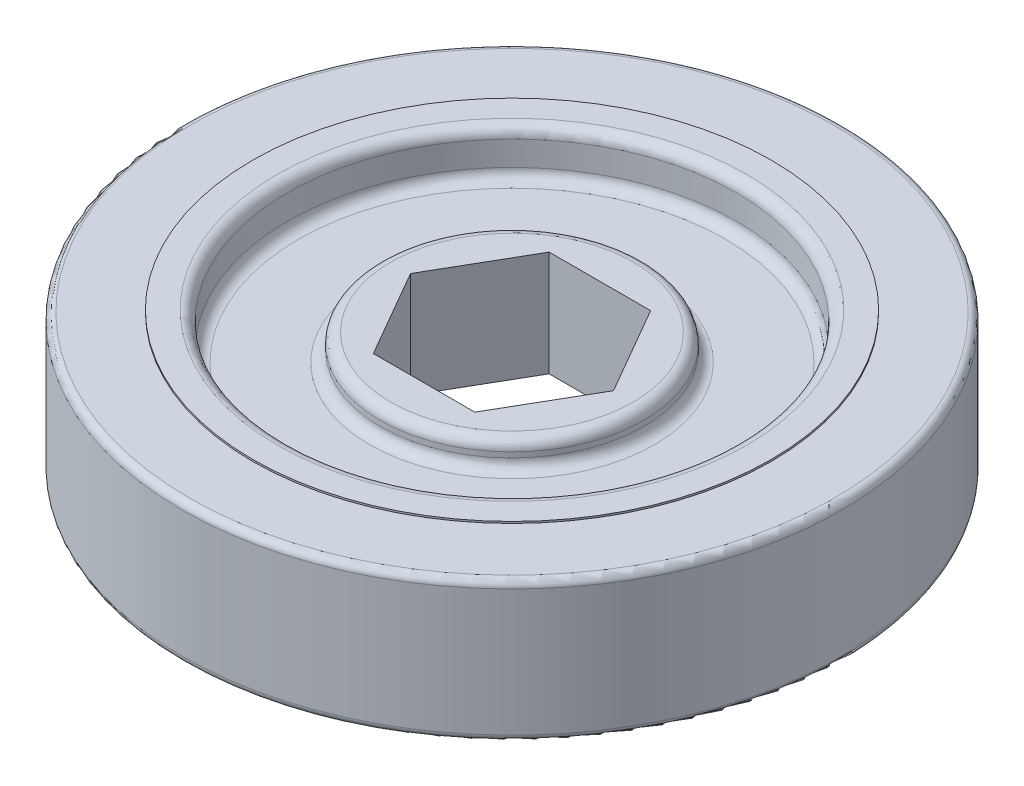
ISO-10303-21;
HEADER;
FILE_DESCRIPTION(('STEP AP214'),'2;1');
FILE_NAME('part.step','',(''),(''),'','','');
FILE_SCHEMA(('AUTOMOTIVE_DESIGN { 1 0 10303 214 1 1 1 1 }'));
ENDSEC;
DATA;
#1=APPLICATION_CONTEXT('core data for automotive mechanical design processes');
#2=APPLICATION_PROTOCOL_DEFINITION('international standard','automotive_design',2000,#1);
#3=PRODUCT_CONTEXT('',#1,'mechanical');
#4=PRODUCT('Part','Part','',(#3));
#5=PRODUCT_RELATED_PRODUCT_CATEGORY('part','',(#4));
#6=PRODUCT_DEFINITION_FORMATION('','',#4);
#7=PRODUCT_DEFINITION_CONTEXT('part definition',#1,'design');
#8=PRODUCT_DEFINITION('design','',#6,#7);
#9=PRODUCT_DEFINITION_SHAPE('','',#8);
#10=(LENGTH_UNIT() NAMED_UNIT(*) SI_UNIT(.MILLI.,.METRE.));
#11=(NAMED_UNIT(*) PLANE_ANGLE_UNIT() SI_UNIT($,.RADIAN.));
#12=(NAMED_UNIT(*) SI_UNIT($,.STERADIAN.) SOLID_ANGLE_UNIT());
#13=UNCERTAINTY_MEASURE_WITH_UNIT(LENGTH_MEASURE(1.E-05),#10,'distance_accuracy_value','');
#14=(GEOMETRIC_REPRESENTATION_CONTEXT(3) GLOBAL_UNCERTAINTY_ASSIGNED_CONTEXT((#13)) GLOBAL_UNIT_ASSIGNED_CONTEXT((#10,
#11,#12)) REPRESENTATION_CONTEXT('',''));
#15=CARTESIAN_POINT('',(0.,0.,0.));
#16=DIRECTION('',(0.,0.,1.));
#17=DIRECTION('',(1.,0.,0.));
#18=AXIS2_PLACEMENT_3D('',#15,#16,#17);
#19=CARTESIAN_POINT('',(0.,5.207,0.));
#20=DIRECTION('',(0.,-1.,0.));
#21=DIRECTION('',(0.,0.,-1.));
#22=AXIS2_PLACEMENT_3D('',#19,#20,#21);
#23=CYLINDRICAL_SURFACE('',#22,16.1925);
#24=CARTESIAN_POINT('',(0.,-2.667,0.));
#25=DIRECTION('',(0.,1.,0.));
#26=DIRECTION('',(0.,0.,1.));
#27=AXIS2_PLACEMENT_3D('',#24,#25,#26);
#28=CIRCLE('',#27,16.1925);
#29=CARTESIAN_POINT('',(0.,-2.667,16.1925));
#30=VERTEX_POINT('',#29);
#31=EDGE_CURVE('E184',#30,#30,#28,.T.);
#32=ORIENTED_EDGE('',*,*,#31,.T.);
#33=EDGE_LOOP('',(#32));
#34=FACE_BOUND('',#33,.T.);
#35=CARTESIAN_POINT('',(0.,-4.445,0.));
#36=DIRECTION('',(0.,1.,0.));
#37=DIRECTION('',(0.,0.,1.));
#38=AXIS2_PLACEMENT_3D('',#35,#36,#37);
#39=CIRCLE('',#38,16.1925);
#40=CARTESIAN_POINT('',(0.,-4.445,16.1925));
#41=VERTEX_POINT('',#40);
#42=EDGE_CURVE('E180',#41,#41,#39,.F.);
#43=ORIENTED_EDGE('',*,*,#42,.T.);
#44=EDGE_LOOP('',(#43));
#45=FACE_BOUND('',#44,.T.);
#46=ADVANCED_FACE('F43',(#34,#45),#23,.F.);
#47=CARTESIAN_POINT('',(0.,5.08,0.));
#48=DIRECTION('',(0.,-1.,0.));
#49=DIRECTION('',(0.,0.,-1.));
#50=AXIS2_PLACEMENT_3D('',#47,#48,#49);
#51=CYLINDRICAL_SURFACE('',#50,23.8125);
#52=CARTESIAN_POINT('',(0.,-4.572,0.));
#53=DIRECTION('',(0.,1.,0.));
#54=DIRECTION('',(0.,0.,1.));
#55=AXIS2_PLACEMENT_3D('',#52,#53,#54);
#56=CIRCLE('',#55,23.8125);
#57=CARTESIAN_POINT('',(0.,-4.572,23.8125));
#58=VERTEX_POINT('',#57);
#59=EDGE_CURVE('E248',#58,#58,#56,.T.);
#60=ORIENTED_EDGE('',*,*,#59,.T.);
#61=EDGE_LOOP('',(#60));
#62=FACE_BOUND('',#61,.T.);
#63=CARTESIAN_POINT('',(0.,4.572,0.));
#64=DIRECTION('',(0.,1.,0.));
#65=DIRECTION('',(0.,0.,1.));
#66=AXIS2_PLACEMENT_3D('',#63,#64,#65);
#67=CIRCLE('',#66,23.8125);
#68=CARTESIAN_POINT('',(0.,4.572,23.8125));
#69=VERTEX_POINT('',#68);
#70=EDGE_CURVE('E244',#69,#69,#67,.F.);
#71=ORIENTED_EDGE('',*,*,#70,.T.);
#72=EDGE_LOOP('',(#71));
#73=FACE_BOUND('',#72,.T.);
#74=ADVANCED_FACE('F264',(#62,#73),#51,.T.);
#75=CARTESIAN_POINT('',(0.,5.08,0.));
#76=DIRECTION('',(0.,1.,0.));
#77=DIRECTION('',(0.,0.,1.));
#78=AXIS2_PLACEMENT_3D('',#75,#76,#77);
#79=PLANE('',#78);
#80=CARTESIAN_POINT('',(0.,5.08,0.));
#81=DIRECTION('',(0.,1.,0.));
#82=DIRECTION('',(0.,0.,1.));
#83=AXIS2_PLACEMENT_3D('',#80,#81,#82);
#84=CIRCLE('',#83,23.3045);
#85=CARTESIAN_POINT('',(0.,5.08,23.3045));
#86=VERTEX_POINT('',#85);
#87=EDGE_CURVE('E11',#86,#86,#84,.T.);
#88=ORIENTED_EDGE('',*,*,#87,.T.);
#89=EDGE_LOOP('',(#88));
#90=FACE_BOUND('',#89,.T.);
#91=CARTESIAN_POINT('',(0.,5.08,0.));
#92=DIRECTION('',(0.,1.,0.));
#93=DIRECTION('',(0.,0.,1.));
#94=AXIS2_PLACEMENT_3D('',#91,#92,#93);
#95=CIRCLE('',#94,18.7325);
#96=CARTESIAN_POINT('',(0.,5.08,18.7325));
#97=VERTEX_POINT('',#96);
#98=EDGE_CURVE('E176',#97,#97,#95,.T.);
#99=ORIENTED_EDGE('',*,*,#98,.F.);
#100=EDGE_LOOP('',(#99));
#101=FACE_BOUND('',#100,.T.);
#102=ADVANCED_FACE('F267',(#90,#101),#79,.T.);
#103=CARTESIAN_POINT('',(0.,-5.08,0.));
#104=DIRECTION('',(0.,1.,0.));
#105=DIRECTION('',(0.,0.,1.));
#106=AXIS2_PLACEMENT_3D('',#103,#104,#105);
#107=PLANE('',#106);
#108=CARTESIAN_POINT('',(0.,-5.08,0.));
#109=DIRECTION('',(0.,1.,0.));
#110=DIRECTION('',(0.,0.,1.));
#111=AXIS2_PLACEMENT_3D('',#108,#109,#110);
#112=CIRCLE('',#111,23.3045);
#113=CARTESIAN_POINT('',(0.,-5.08,23.3045));
#114=VERTEX_POINT('',#113);
#115=EDGE_CURVE('E53',#114,#114,#112,.F.);
#116=ORIENTED_EDGE('',*,*,#115,.T.);
#117=EDGE_LOOP('',(#116));
#118=FACE_BOUND('',#117,.T.);
#119=CARTESIAN_POINT('',(0.,-5.08,0.));
#120=DIRECTION('',(0.,1.,0.));
#121=DIRECTION('',(0.,0.,1.));
#122=AXIS2_PLACEMENT_3D('',#119,#120,#121);
#123=CIRCLE('',#122,18.7325);
#124=CARTESIAN_POINT('',(0.,-5.08,18.7325));
#125=VERTEX_POINT('',#124);
#126=EDGE_CURVE('E169',#125,#125,#123,.F.);
#127=ORIENTED_EDGE('',*,*,#126,.F.);
#128=EDGE_LOOP('',(#127));
#129=FACE_BOUND('',#128,.T.);
#130=ADVANCED_FACE('F255',(#118,#129),#107,.F.);
#131=CARTESIAN_POINT('',(0.,5.207,0.));
#132=DIRECTION('',(0.,-1.,0.));
#133=DIRECTION('',(0.,0.,-1.));
#134=AXIS2_PLACEMENT_3D('',#131,#132,#133);
#135=CYLINDRICAL_SURFACE('',#134,18.7325);
#136=CARTESIAN_POINT('',(0.,-5.207,0.));
#137=DIRECTION('',(0.,1.,0.));
#138=DIRECTION('',(0.,0.,1.));
#139=AXIS2_PLACEMENT_3D('',#136,#137,#138);
#140=CIRCLE('',#139,18.7325);
#141=CARTESIAN_POINT('',(0.,-5.207,18.7325));
#142=VERTEX_POINT('',#141);
#143=EDGE_CURVE('E164',#142,#142,#140,.T.);
#144=ORIENTED_EDGE('',*,*,#143,.T.);
#145=EDGE_LOOP('',(#144));
#146=FACE_BOUND('',#145,.T.);
#147=ORIENTED_EDGE('',*,*,#126,.T.);
#148=EDGE_LOOP('',(#147));
#149=FACE_BOUND('',#148,.T.);
#150=ADVANCED_FACE('F286',(#146,#149),#135,.T.);
#151=CARTESIAN_POINT('',(0.,4.445,0.));
#152=DIRECTION('',(0.,1.,0.));
#153=DIRECTION('',(0.,0.,1.));
#154=AXIS2_PLACEMENT_3D('',#151,#152,#153);
#155=CIRCLE('',#154,16.1925);
#156=CARTESIAN_POINT('',(0.,4.445,16.1925));
#157=VERTEX_POINT('',#156);
#158=EDGE_CURVE('E216',#157,#157,#155,.T.);
#159=ORIENTED_EDGE('',*,*,#158,.T.);
#160=EDGE_LOOP('',(#159));
#161=FACE_BOUND('',#160,.T.);
#162=CARTESIAN_POINT('',(0.,2.667,0.));
#163=DIRECTION('',(0.,1.,0.));
#164=DIRECTION('',(0.,0.,1.));
#165=AXIS2_PLACEMENT_3D('',#162,#163,#164);
#166=CIRCLE('',#165,16.1925);
#167=CARTESIAN_POINT('',(0.,2.667,16.1925));
#168=VERTEX_POINT('',#167);
#169=EDGE_CURVE('E212',#168,#168,#166,.F.);
#170=ORIENTED_EDGE('',*,*,#169,.T.);
#171=EDGE_LOOP('',(#170));
#172=FACE_BOUND('',#171,.T.);
#173=ADVANCED_FACE('F284',(#161,#172),#23,.F.);
#174=ORIENTED_EDGE('',*,*,#98,.T.);
#175=EDGE_LOOP('',(#174));
#176=FACE_BOUND('',#175,.T.);
#177=CARTESIAN_POINT('',(0.,5.207,0.));
#178=DIRECTION('',(0.,1.,0.));
#179=DIRECTION('',(0.,0.,1.));
#180=AXIS2_PLACEMENT_3D('',#177,#178,#179);
#181=CIRCLE('',#180,18.7325);
#182=CARTESIAN_POINT('',(0.,5.207,18.7325));
#183=VERTEX_POINT('',#182);
#184=EDGE_CURVE('E165',#183,#183,#181,.T.);
#185=ORIENTED_EDGE('',*,*,#184,.F.);
#186=EDGE_LOOP('',(#185));
#187=FACE_BOUND('',#186,.T.);
#188=ADVANCED_FACE('F280',(#176,#187),#135,.T.);
#189=CARTESIAN_POINT('',(0.,5.207,0.));
#190=DIRECTION('',(0.,1.,0.));
#191=DIRECTION('',(0.,0.,1.));
#192=AXIS2_PLACEMENT_3D('',#189,#190,#191);
#193=PLANE('',#192);
#194=CARTESIAN_POINT('',(0.,5.207,0.));
#195=DIRECTION('',(0.,1.,0.));
#196=DIRECTION('',(0.,0.,1.));
#197=AXIS2_PLACEMENT_3D('',#194,#195,#196);
#198=CIRCLE('',#197,16.9545);
#199=CARTESIAN_POINT('',(0.,5.207,16.9545));
#200=VERTEX_POINT('',#199);
#201=EDGE_CURVE('E220',#200,#200,#198,.F.);
#202=ORIENTED_EDGE('',*,*,#201,.T.);
#203=EDGE_LOOP('',(#202));
#204=FACE_BOUND('',#203,.T.);
#205=ORIENTED_EDGE('',*,*,#184,.T.);
#206=EDGE_LOOP('',(#205));
#207=FACE_BOUND('',#206,.T.);
#208=ADVANCED_FACE('F283',(#204,#207),#193,.T.);
#209=CARTESIAN_POINT('',(0.,-5.207,0.));
#210=DIRECTION('',(0.,1.,0.));
#211=DIRECTION('',(0.,0.,1.));
#212=AXIS2_PLACEMENT_3D('',#209,#210,#211);
#213=PLANE('',#212);
#214=CARTESIAN_POINT('',(0.,-5.207,0.));
#215=DIRECTION('',(0.,1.,0.));
#216=DIRECTION('',(0.,0.,1.));
#217=AXIS2_PLACEMENT_3D('',#214,#215,#216);
#218=CIRCLE('',#217,16.9545);
#219=CARTESIAN_POINT('',(0.,-5.207,16.9545));
#220=VERTEX_POINT('',#219);
#221=EDGE_CURVE('E208',#220,#220,#218,.T.);
#222=ORIENTED_EDGE('',*,*,#221,.T.);
#223=EDGE_LOOP('',(#222));
#224=FACE_BOUND('',#223,.T.);
#225=ORIENTED_EDGE('',*,*,#143,.F.);
#226=EDGE_LOOP('',(#225));
#227=FACE_BOUND('',#226,.T.);
#228=ADVANCED_FACE('F290',(#224,#227),#213,.F.);
#229=CARTESIAN_POINT('',(0.,1.905,0.));
#230=DIRECTION('',(0.,1.,0.));
#231=DIRECTION('',(0.,0.,1.));
#232=AXIS2_PLACEMENT_3D('',#229,#230,#231);
#233=PLANE('',#232);
#234=CARTESIAN_POINT('',(0.,1.905,0.));
#235=DIRECTION('',(0.,1.,0.));
#236=DIRECTION('',(0.,0.,1.));
#237=AXIS2_PLACEMENT_3D('',#234,#235,#236);
#238=CIRCLE('',#237,15.4305);
#239=CARTESIAN_POINT('',(0.,1.905,15.4305));
#240=VERTEX_POINT('',#239);
#241=EDGE_CURVE('E228',#240,#240,#238,.T.);
#242=ORIENTED_EDGE('',*,*,#241,.T.);
#243=EDGE_LOOP('',(#242));
#244=FACE_BOUND('',#243,.T.);
#245=CARTESIAN_POINT('',(0.,1.905,0.));
#246=DIRECTION('',(0.,1.,0.));
#247=DIRECTION('',(0.,0.,1.));
#248=AXIS2_PLACEMENT_3D('',#245,#246,#247);
#249=CIRCLE('',#248,10.287);
#250=CARTESIAN_POINT('',(0.,1.905,10.287));
#251=VERTEX_POINT('',#250);
#252=EDGE_CURVE('E224',#251,#251,#249,.F.);
#253=ORIENTED_EDGE('',*,*,#252,.T.);
#254=EDGE_LOOP('',(#253));
#255=FACE_BOUND('',#254,.T.);
#256=ADVANCED_FACE('F296',(#244,#255),#233,.T.);
#257=CARTESIAN_POINT('',(0.,-1.905,0.));
#258=DIRECTION('',(0.,1.,0.));
#259=DIRECTION('',(0.,0.,1.));
#260=AXIS2_PLACEMENT_3D('',#257,#258,#259);
#261=PLANE('',#260);
#262=CARTESIAN_POINT('',(0.,-1.905,0.));
#263=DIRECTION('',(0.,1.,0.));
#264=DIRECTION('',(0.,0.,1.));
#265=AXIS2_PLACEMENT_3D('',#262,#263,#264);
#266=CIRCLE('',#265,15.4305);
#267=CARTESIAN_POINT('',(0.,-1.905,15.4305));
#268=VERTEX_POINT('',#267);
#269=EDGE_CURVE('E192',#268,#268,#266,.F.);
#270=ORIENTED_EDGE('',*,*,#269,.T.);
#271=EDGE_LOOP('',(#270));
#272=FACE_BOUND('',#271,.T.);
#273=CARTESIAN_POINT('',(0.,-1.905,0.));
#274=DIRECTION('',(0.,1.,0.));
#275=DIRECTION('',(0.,0.,1.));
#276=AXIS2_PLACEMENT_3D('',#273,#274,#275);
#277=CIRCLE('',#276,10.287);
#278=CARTESIAN_POINT('',(0.,-1.905,10.287));
#279=VERTEX_POINT('',#278);
#280=EDGE_CURVE('E188',#279,#279,#277,.T.);
#281=ORIENTED_EDGE('',*,*,#280,.T.);
#282=EDGE_LOOP('',(#281));
#283=FACE_BOUND('',#282,.T.);
#284=ADVANCED_FACE('F326',(#272,#283),#261,.F.);
#285=CARTESIAN_POINT('',(0.,3.81,0.));
#286=DIRECTION('',(0.,-1.,0.));
#287=DIRECTION('',(0.,0.,-1.));
#288=AXIS2_PLACEMENT_3D('',#285,#286,#287);
#289=CYLINDRICAL_SURFACE('',#288,9.525);
#290=CARTESIAN_POINT('',(0.,-3.048,0.));
#291=DIRECTION('',(0.,1.,0.));
#292=DIRECTION('',(0.,0.,1.));
#293=AXIS2_PLACEMENT_3D('',#290,#291,#292);
#294=CIRCLE('',#293,9.525);
#295=CARTESIAN_POINT('',(0.,-3.048,9.525));
#296=VERTEX_POINT('',#295);
#297=EDGE_CURVE('E200',#296,#296,#294,.T.);
#298=ORIENTED_EDGE('',*,*,#297,.T.);
#299=EDGE_LOOP('',(#298));
#300=FACE_BOUND('',#299,.T.);
#301=CARTESIAN_POINT('',(0.,-2.667,0.));
#302=DIRECTION('',(0.,1.,0.));
#303=DIRECTION('',(0.,0.,1.));
#304=AXIS2_PLACEMENT_3D('',#301,#302,#303);
#305=CIRCLE('',#304,9.525);
#306=CARTESIAN_POINT('',(0.,-2.667,9.525));
#307=VERTEX_POINT('',#306);
#308=EDGE_CURVE('E196',#307,#307,#305,.F.);
#309=ORIENTED_EDGE('',*,*,#308,.T.);
#310=EDGE_LOOP('',(#309));
#311=FACE_BOUND('',#310,.T.);
#312=ADVANCED_FACE('F340',(#300,#311),#289,.T.);
#313=CARTESIAN_POINT('',(5.49926131403119,3.81,-3.175));
#314=DIRECTION('',(-0.866025403784439,0.,0.5));
#315=DIRECTION('',(0.5,0.,0.866025403784439));
#316=AXIS2_PLACEMENT_3D('',#313,#314,#315);
#317=PLANE('',#316);
#318=DIRECTION('',(-0.5,0.,-0.866025403784439));
#319=VECTOR('',#318,1.);
#320=CARTESIAN_POINT('',(5.49926131403119,-3.81,-3.175));
#321=LINE('',#320,#319);
#322=CARTESIAN_POINT('',(7.33234841870825,-3.81,0.));
#323=VERTEX_POINT('',#322);
#324=CARTESIAN_POINT('',(3.66617420935413,-3.81,-6.35));
#325=VERTEX_POINT('',#324);
#326=EDGE_CURVE('E132',#323,#325,#321,.T.);
#327=ORIENTED_EDGE('',*,*,#326,.F.);
#328=DIRECTION('',(0.,-1.,0.));
#329=VECTOR('',#328,1.);
#330=CARTESIAN_POINT('',(7.33234841870825,3.81,0.));
#331=LINE('',#330,#329);
#332=CARTESIAN_POINT('',(7.33234841870825,3.81,0.));
#333=VERTEX_POINT('',#332);
#334=EDGE_CURVE('E90',#333,#323,#331,.T.);
#335=ORIENTED_EDGE('',*,*,#334,.F.);
#336=DIRECTION('',(-0.5,0.,-0.866025403784439));
#337=VECTOR('',#336,1.);
#338=CARTESIAN_POINT('',(5.49926131403119,3.81,-3.175));
#339=LINE('',#338,#337);
#340=CARTESIAN_POINT('',(3.66617420935413,3.81,-6.35));
#341=VERTEX_POINT('',#340);
#342=EDGE_CURVE('E152',#333,#341,#339,.T.);
#343=ORIENTED_EDGE('',*,*,#342,.T.);
#344=DIRECTION('',(0.,-1.,0.));
#345=VECTOR('',#344,1.);
#346=CARTESIAN_POINT('',(3.66617420935413,3.81,-6.35));
#347=LINE('',#346,#345);
#348=EDGE_CURVE('E61',#341,#325,#347,.T.);
#349=ORIENTED_EDGE('',*,*,#348,.T.);
#350=EDGE_LOOP('',(#327,#335,#343,#349));
#351=FACE_BOUND('',#350,.T.);
#352=ADVANCED_FACE('F351',(#351),#317,.T.);
#353=CARTESIAN_POINT('',(5.49926131403119,3.81,3.175));
#354=DIRECTION('',(-0.866025403784438,0.,-0.5));
#355=DIRECTION('',(-0.5,0.,0.866025403784439));
#356=AXIS2_PLACEMENT_3D('',#353,#354,#355);
#357=PLANE('',#356);
#358=DIRECTION('',(0.5,0.,-0.866025403784439));
#359=VECTOR('',#358,1.);
#360=CARTESIAN_POINT('',(5.49926131403119,-3.81,3.175));
#361=LINE('',#360,#359);
#362=CARTESIAN_POINT('',(3.66617420935412,-3.81,6.35));
#363=VERTEX_POINT('',#362);
#364=EDGE_CURVE('E135',#363,#323,#361,.T.);
#365=ORIENTED_EDGE('',*,*,#364,.F.);
#366=DIRECTION('',(0.,-1.,0.));
#367=VECTOR('',#366,1.);
#368=CARTESIAN_POINT('',(3.66617420935412,3.81,6.35));
#369=LINE('',#368,#367);
#370=CARTESIAN_POINT('',(3.66617420935412,3.81,6.35));
#371=VERTEX_POINT('',#370);
#372=EDGE_CURVE('E159',#371,#363,#369,.T.);
#373=ORIENTED_EDGE('',*,*,#372,.F.);
#374=DIRECTION('',(0.5,0.,-0.866025403784439));
#375=VECTOR('',#374,1.);
#376=CARTESIAN_POINT('',(5.49926131403119,3.81,3.175));
#377=LINE('',#376,#375);
#378=EDGE_CURVE('E600',#371,#333,#377,.T.);
#379=ORIENTED_EDGE('',*,*,#378,.T.);
#380=ORIENTED_EDGE('',*,*,#334,.T.);
#381=EDGE_LOOP('',(#365,#373,#379,#380));
#382=FACE_BOUND('',#381,.T.);
#383=ADVANCED_FACE('F357',(#382),#357,.T.);
#384=CARTESIAN_POINT('',(0.,3.81,6.35));
#385=DIRECTION('',(0.,0.,-1.));
#386=DIRECTION('',(-1.,0.,0.));
#387=AXIS2_PLACEMENT_3D('',#384,#385,#386);
#388=PLANE('',#387);
#389=DIRECTION('',(1.,0.,0.));
#390=VECTOR('',#389,1.);
#391=CARTESIAN_POINT('',(0.,-3.81,6.35));
#392=LINE('',#391,#390);
#393=CARTESIAN_POINT('',(-3.66617420935413,-3.81,6.35));
#394=VERTEX_POINT('',#393);
#395=EDGE_CURVE('E139',#394,#363,#392,.T.);
#396=ORIENTED_EDGE('',*,*,#395,.F.);
#397=DIRECTION('',(0.,-1.,0.));
#398=VECTOR('',#397,1.);
#399=CARTESIAN_POINT('',(-3.66617420935413,3.81,6.35));
#400=LINE('',#399,#398);
#401=CARTESIAN_POINT('',(-3.66617420935413,3.81,6.35));
#402=VERTEX_POINT('',#401);
#403=EDGE_CURVE('E111',#402,#394,#400,.T.);
#404=ORIENTED_EDGE('',*,*,#403,.F.);
#405=DIRECTION('',(1.,0.,0.));
#406=VECTOR('',#405,1.);
#407=CARTESIAN_POINT('',(0.,3.81,6.35));
#408=LINE('',#407,#406);
#409=EDGE_CURVE('E121',#402,#371,#408,.T.);
#410=ORIENTED_EDGE('',*,*,#409,.T.);
#411=ORIENTED_EDGE('',*,*,#372,.T.);
#412=EDGE_LOOP('',(#396,#404,#410,#411));
#413=FACE_BOUND('',#412,.T.);
#414=ADVANCED_FACE('F468',(#413),#388,.T.);
#415=CARTESIAN_POINT('',(-5.49926131403119,3.81,3.175));
#416=DIRECTION('',(0.866025403784439,0.,-0.5));
#417=DIRECTION('',(-0.5,0.,-0.866025403784439));
#418=AXIS2_PLACEMENT_3D('',#415,#416,#417);
#419=PLANE('',#418);
#420=DIRECTION('',(0.5,0.,0.866025403784439));
#421=VECTOR('',#420,1.);
#422=CARTESIAN_POINT('',(-5.49926131403119,-3.81,3.175));
#423=LINE('',#422,#421);
#424=CARTESIAN_POINT('',(-7.33234841870825,-3.81,0.));
#425=VERTEX_POINT('',#424);
#426=EDGE_CURVE('E106',#425,#394,#423,.T.);
#427=ORIENTED_EDGE('',*,*,#426,.F.);
#428=DIRECTION('',(0.,-1.,0.));
#429=VECTOR('',#428,1.);
#430=CARTESIAN_POINT('',(-7.33234841870825,3.81,0.));
#431=LINE('',#430,#429);
#432=CARTESIAN_POINT('',(-7.33234841870825,3.81,0.));
#433=VERTEX_POINT('',#432);
#434=EDGE_CURVE('E101',#433,#425,#431,.T.);
#435=ORIENTED_EDGE('',*,*,#434,.F.);
#436=DIRECTION('',(0.5,0.,0.866025403784439));
#437=VECTOR('',#436,1.);
#438=CARTESIAN_POINT('',(-5.49926131403119,3.81,3.175));
#439=LINE('',#438,#437);
#440=EDGE_CURVE('E104',#433,#402,#439,.T.);
#441=ORIENTED_EDGE('',*,*,#440,.T.);
#442=ORIENTED_EDGE('',*,*,#403,.T.);
#443=EDGE_LOOP('',(#427,#435,#441,#442));
#444=FACE_BOUND('',#443,.T.);
#445=ADVANCED_FACE('F103',(#444),#419,.T.);
#446=CARTESIAN_POINT('',(-5.49926131403119,3.81,-3.175));
#447=DIRECTION('',(0.866025403784439,0.,0.5));
#448=DIRECTION('',(0.5,0.,-0.866025403784439));
#449=AXIS2_PLACEMENT_3D('',#446,#447,#448);
#450=PLANE('',#449);
#451=DIRECTION('',(-0.5,0.,0.866025403784439));
#452=VECTOR('',#451,1.);
#453=CARTESIAN_POINT('',(-5.49926131403119,-3.81,-3.175));
#454=LINE('',#453,#452);
#455=CARTESIAN_POINT('',(-3.66617420935413,-3.81,-6.35));
#456=VERTEX_POINT('',#455);
#457=EDGE_CURVE('E145',#456,#425,#454,.T.);
#458=ORIENTED_EDGE('',*,*,#457,.F.);
#459=DIRECTION('',(0.,-1.,0.));
#460=VECTOR('',#459,1.);
#461=CARTESIAN_POINT('',(-3.66617420935413,3.81,-6.35));
#462=LINE('',#461,#460);
#463=CARTESIAN_POINT('',(-3.66617420935413,3.81,-6.35));
#464=VERTEX_POINT('',#463);
#465=EDGE_CURVE('E81',#464,#456,#462,.T.);
#466=ORIENTED_EDGE('',*,*,#465,.F.);
#467=DIRECTION('',(-0.5,0.,0.866025403784439));
#468=VECTOR('',#467,1.);
#469=CARTESIAN_POINT('',(-5.49926131403119,3.81,-3.175));
#470=LINE('',#469,#468);
#471=EDGE_CURVE('E118',#464,#433,#470,.T.);
#472=ORIENTED_EDGE('',*,*,#471,.T.);
#473=ORIENTED_EDGE('',*,*,#434,.T.);
#474=EDGE_LOOP('',(#458,#466,#472,#473));
#475=FACE_BOUND('',#474,.T.);
#476=ADVANCED_FACE('F124',(#475),#450,.T.);
#477=CARTESIAN_POINT('',(0.,3.81,-6.35));
#478=DIRECTION('',(0.,0.,1.));
#479=DIRECTION('',(1.,0.,0.));
#480=AXIS2_PLACEMENT_3D('',#477,#478,#479);
#481=PLANE('',#480);
#482=DIRECTION('',(-1.,0.,0.));
#483=VECTOR('',#482,1.);
#484=CARTESIAN_POINT('',(0.,-3.81,-6.35));
#485=LINE('',#484,#483);
#486=EDGE_CURVE('E148',#325,#456,#485,.T.);
#487=ORIENTED_EDGE('',*,*,#486,.F.);
#488=ORIENTED_EDGE('',*,*,#348,.F.);
#489=DIRECTION('',(-1.,0.,0.));
#490=VECTOR('',#489,1.);
#491=CARTESIAN_POINT('',(0.,3.81,-6.35));
#492=LINE('',#491,#490);
#493=EDGE_CURVE('E126',#341,#464,#492,.T.);
#494=ORIENTED_EDGE('',*,*,#493,.T.);
#495=ORIENTED_EDGE('',*,*,#465,.T.);
#496=EDGE_LOOP('',(#487,#488,#494,#495));
#497=FACE_BOUND('',#496,.T.);
#498=ADVANCED_FACE('F337',(#497),#481,.T.);
#499=CARTESIAN_POINT('',(0.,3.048,0.));
#500=DIRECTION('',(0.,1.,0.));
#501=DIRECTION('',(0.,0.,1.));
#502=AXIS2_PLACEMENT_3D('',#499,#500,#501);
#503=CIRCLE('',#502,9.525);
#504=CARTESIAN_POINT('',(0.,3.048,9.525));
#505=VERTEX_POINT('',#504);
#506=EDGE_CURVE('E240',#505,#505,#503,.F.);
#507=ORIENTED_EDGE('',*,*,#506,.T.);
#508=EDGE_LOOP('',(#507));
#509=FACE_BOUND('',#508,.T.);
#510=CARTESIAN_POINT('',(0.,2.667,0.));
#511=DIRECTION('',(0.,1.,0.));
#512=DIRECTION('',(0.,0.,1.));
#513=AXIS2_PLACEMENT_3D('',#510,#511,#512);
#514=CIRCLE('',#513,9.525);
#515=CARTESIAN_POINT('',(0.,2.667,9.525));
#516=VERTEX_POINT('',#515);
#517=EDGE_CURVE('E236',#516,#516,#514,.T.);
#518=ORIENTED_EDGE('',*,*,#517,.T.);
#519=EDGE_LOOP('',(#518));
#520=FACE_BOUND('',#519,.T.);
#521=ADVANCED_FACE('F335',(#509,#520),#289,.T.);
#522=CARTESIAN_POINT('',(0.,3.81,0.));
#523=DIRECTION('',(0.,1.,0.));
#524=DIRECTION('',(0.,0.,1.));
#525=AXIS2_PLACEMENT_3D('',#522,#523,#524);
#526=PLANE('',#525);
#527=CARTESIAN_POINT('',(0.,3.81,0.));
#528=DIRECTION('',(0.,1.,0.));
#529=DIRECTION('',(0.,0.,1.));
#530=AXIS2_PLACEMENT_3D('',#527,#528,#529);
#531=CIRCLE('',#530,8.763);
#532=CARTESIAN_POINT('',(0.,3.81,8.763));
#533=VERTEX_POINT('',#532);
#534=EDGE_CURVE('E232',#533,#533,#531,.T.);
#535=ORIENTED_EDGE('',*,*,#534,.T.);
#536=EDGE_LOOP('',(#535));
#537=FACE_BOUND('',#536,.T.);
#538=ORIENTED_EDGE('',*,*,#342,.F.);
#539=ORIENTED_EDGE('',*,*,#378,.F.);
#540=ORIENTED_EDGE('',*,*,#409,.F.);
#541=ORIENTED_EDGE('',*,*,#440,.F.);
#542=ORIENTED_EDGE('',*,*,#471,.F.);
#543=ORIENTED_EDGE('',*,*,#493,.F.);
#544=EDGE_LOOP('',(#538,#539,#540,#541,#542,#543));
#545=FACE_BOUND('',#544,.T.);
#546=ADVANCED_FACE('F116',(#537,#545),#526,.T.);
#547=CARTESIAN_POINT('',(0.,-3.81,0.));
#548=DIRECTION('',(0.,1.,0.));
#549=DIRECTION('',(0.,0.,1.));
#550=AXIS2_PLACEMENT_3D('',#547,#548,#549);
#551=PLANE('',#550);
#552=CARTESIAN_POINT('',(0.,-3.81,0.));
#553=DIRECTION('',(0.,1.,0.));
#554=DIRECTION('',(0.,0.,1.));
#555=AXIS2_PLACEMENT_3D('',#552,#553,#554);
#556=CIRCLE('',#555,8.763);
#557=CARTESIAN_POINT('',(0.,-3.81,8.763));
#558=VERTEX_POINT('',#557);
#559=EDGE_CURVE('E204',#558,#558,#556,.F.);
#560=ORIENTED_EDGE('',*,*,#559,.T.);
#561=EDGE_LOOP('',(#560));
#562=FACE_BOUND('',#561,.T.);
#563=ORIENTED_EDGE('',*,*,#326,.T.);
#564=ORIENTED_EDGE('',*,*,#486,.T.);
#565=ORIENTED_EDGE('',*,*,#457,.T.);
#566=ORIENTED_EDGE('',*,*,#426,.T.);
#567=ORIENTED_EDGE('',*,*,#395,.T.);
#568=ORIENTED_EDGE('',*,*,#364,.T.);
#569=EDGE_LOOP('',(#563,#564,#565,#566,#567,#568));
#570=FACE_BOUND('',#569,.T.);
#571=ADVANCED_FACE('F345',(#562,#570),#551,.F.);
#572=CARTESIAN_POINT('',(0.,-2.667,0.));
#573=DIRECTION('',(0.,1.,0.));
#574=DIRECTION('',(0.,0.,1.));
#575=AXIS2_PLACEMENT_3D('',#572,#573,#574);
#576=TOROIDAL_SURFACE('',#575,15.4305,0.762);
#577=ORIENTED_EDGE('',*,*,#269,.F.);
#578=EDGE_LOOP('',(#577));
#579=FACE_BOUND('',#578,.T.);
#580=ORIENTED_EDGE('',*,*,#31,.F.);
#581=EDGE_LOOP('',(#580));
#582=FACE_BOUND('',#581,.T.);
#583=ADVANCED_FACE('F376',(#579,#582),#576,.F.);
#584=CARTESIAN_POINT('',(0.,-3.048,0.));
#585=DIRECTION('',(0.,1.,0.));
#586=DIRECTION('',(0.,0.,1.));
#587=AXIS2_PLACEMENT_3D('',#584,#585,#586);
#588=TOROIDAL_SURFACE('',#587,8.763,0.762);
#589=ORIENTED_EDGE('',*,*,#559,.F.);
#590=EDGE_LOOP('',(#589));
#591=FACE_BOUND('',#590,.T.);
#592=ORIENTED_EDGE('',*,*,#297,.F.);
#593=EDGE_LOOP('',(#592));
#594=FACE_BOUND('',#593,.T.);
#595=ADVANCED_FACE('F367',(#591,#594),#588,.T.);
#596=CARTESIAN_POINT('',(0.,-2.667,0.));
#597=DIRECTION('',(0.,1.,0.));
#598=DIRECTION('',(0.,0.,1.));
#599=AXIS2_PLACEMENT_3D('',#596,#597,#598);
#600=TOROIDAL_SURFACE('',#599,10.287,0.762);
#601=ORIENTED_EDGE('',*,*,#280,.F.);
#602=EDGE_LOOP('',(#601));
#603=FACE_BOUND('',#602,.T.);
#604=ORIENTED_EDGE('',*,*,#308,.F.);
#605=EDGE_LOOP('',(#604));
#606=FACE_BOUND('',#605,.T.);
#607=ADVANCED_FACE('F364',(#603,#606),#600,.F.);
#608=CARTESIAN_POINT('',(0.,-4.445,0.));
#609=DIRECTION('',(0.,1.,0.));
#610=DIRECTION('',(0.,0.,1.));
#611=AXIS2_PLACEMENT_3D('',#608,#609,#610);
#612=TOROIDAL_SURFACE('',#611,16.9545,0.762);
#613=ORIENTED_EDGE('',*,*,#42,.F.);
#614=EDGE_LOOP('',(#613));
#615=FACE_BOUND('',#614,.T.);
#616=ORIENTED_EDGE('',*,*,#221,.F.);
#617=EDGE_LOOP('',(#616));
#618=FACE_BOUND('',#617,.T.);
#619=ADVANCED_FACE('F366',(#615,#618),#612,.T.);
#620=CARTESIAN_POINT('',(0.,4.445,0.));
#621=DIRECTION('',(0.,1.,0.));
#622=DIRECTION('',(0.,0.,1.));
#623=AXIS2_PLACEMENT_3D('',#620,#621,#622);
#624=TOROIDAL_SURFACE('',#623,16.9545,0.762);
#625=ORIENTED_EDGE('',*,*,#201,.F.);
#626=EDGE_LOOP('',(#625));
#627=FACE_BOUND('',#626,.T.);
#628=ORIENTED_EDGE('',*,*,#158,.F.);
#629=EDGE_LOOP('',(#628));
#630=FACE_BOUND('',#629,.T.);
#631=ADVANCED_FACE('F320',(#627,#630),#624,.T.);
#632=CARTESIAN_POINT('',(0.,2.667,0.));
#633=DIRECTION('',(0.,1.,0.));
#634=DIRECTION('',(0.,0.,1.));
#635=AXIS2_PLACEMENT_3D('',#632,#633,#634);
#636=TOROIDAL_SURFACE('',#635,15.4305,0.762);
#637=ORIENTED_EDGE('',*,*,#169,.F.);
#638=EDGE_LOOP('',(#637));
#639=FACE_BOUND('',#638,.T.);
#640=ORIENTED_EDGE('',*,*,#241,.F.);
#641=EDGE_LOOP('',(#640));
#642=FACE_BOUND('',#641,.T.);
#643=ADVANCED_FACE('F316',(#639,#642),#636,.F.);
#644=CARTESIAN_POINT('',(0.,3.048,0.));
#645=DIRECTION('',(0.,1.,0.));
#646=DIRECTION('',(0.,0.,1.));
#647=AXIS2_PLACEMENT_3D('',#644,#645,#646);
#648=TOROIDAL_SURFACE('',#647,8.763,0.762);
#649=ORIENTED_EDGE('',*,*,#506,.F.);
#650=EDGE_LOOP('',(#649));
#651=FACE_BOUND('',#650,.T.);
#652=ORIENTED_EDGE('',*,*,#534,.F.);
#653=EDGE_LOOP('',(#652));
#654=FACE_BOUND('',#653,.T.);
#655=ADVANCED_FACE('F319',(#651,#654),#648,.T.);
#656=CARTESIAN_POINT('',(0.,2.667,0.));
#657=DIRECTION('',(0.,1.,0.));
#658=DIRECTION('',(0.,0.,1.));
#659=AXIS2_PLACEMENT_3D('',#656,#657,#658);
#660=TOROIDAL_SURFACE('',#659,10.287,0.762);
#661=ORIENTED_EDGE('',*,*,#252,.F.);
#662=EDGE_LOOP('',(#661));
#663=FACE_BOUND('',#662,.T.);
#664=ORIENTED_EDGE('',*,*,#517,.F.);
#665=EDGE_LOOP('',(#664));
#666=FACE_BOUND('',#665,.T.);
#667=ADVANCED_FACE('F261',(#663,#666),#660,.F.);
#668=CARTESIAN_POINT('',(0.,-4.572,0.));
#669=DIRECTION('',(0.,1.,0.));
#670=DIRECTION('',(0.,0.,1.));
#671=AXIS2_PLACEMENT_3D('',#668,#669,#670);
#672=TOROIDAL_SURFACE('',#671,23.3045,0.508);
#673=ORIENTED_EDGE('',*,*,#115,.F.);
#674=EDGE_LOOP('',(#673));
#675=FACE_BOUND('',#674,.T.);
#676=ORIENTED_EDGE('',*,*,#59,.F.);
#677=EDGE_LOOP('',(#676));
#678=FACE_BOUND('',#677,.T.);
#679=ADVANCED_FACE('F258',(#675,#678),#672,.T.);
#680=CARTESIAN_POINT('',(0.,4.572,0.));
#681=DIRECTION('',(0.,1.,0.));
#682=DIRECTION('',(0.,0.,1.));
#683=AXIS2_PLACEMENT_3D('',#680,#681,#682);
#684=TOROIDAL_SURFACE('',#683,23.3045,0.508);
#685=ORIENTED_EDGE('',*,*,#70,.F.);
#686=EDGE_LOOP('',(#685));
#687=FACE_BOUND('',#686,.T.);
#688=ORIENTED_EDGE('',*,*,#87,.F.);
#689=EDGE_LOOP('',(#688));
#690=FACE_BOUND('',#689,.T.);
#691=ADVANCED_FACE('F45',(#687,#690),#684,.T.);
#692=CLOSED_SHELL('',(#46,#74,#102,#130,#150,#173,#188,#208,#228,#256,#284,#312,#352,#383,#414,
#445,#476,#498,#521,#546,#571,#583,#595,#607,#619,#631,#643,#655,#667,#679,#691));
#693=MANIFOLD_SOLID_BREP('B2',#692);
#694=ADVANCED_BREP_SHAPE_REPRESENTATION('',(#18,#693),#14);
#695=SHAPE_DEFINITION_REPRESENTATION(#9,#694);
ENDSEC;
END-ISO-10303-21;
